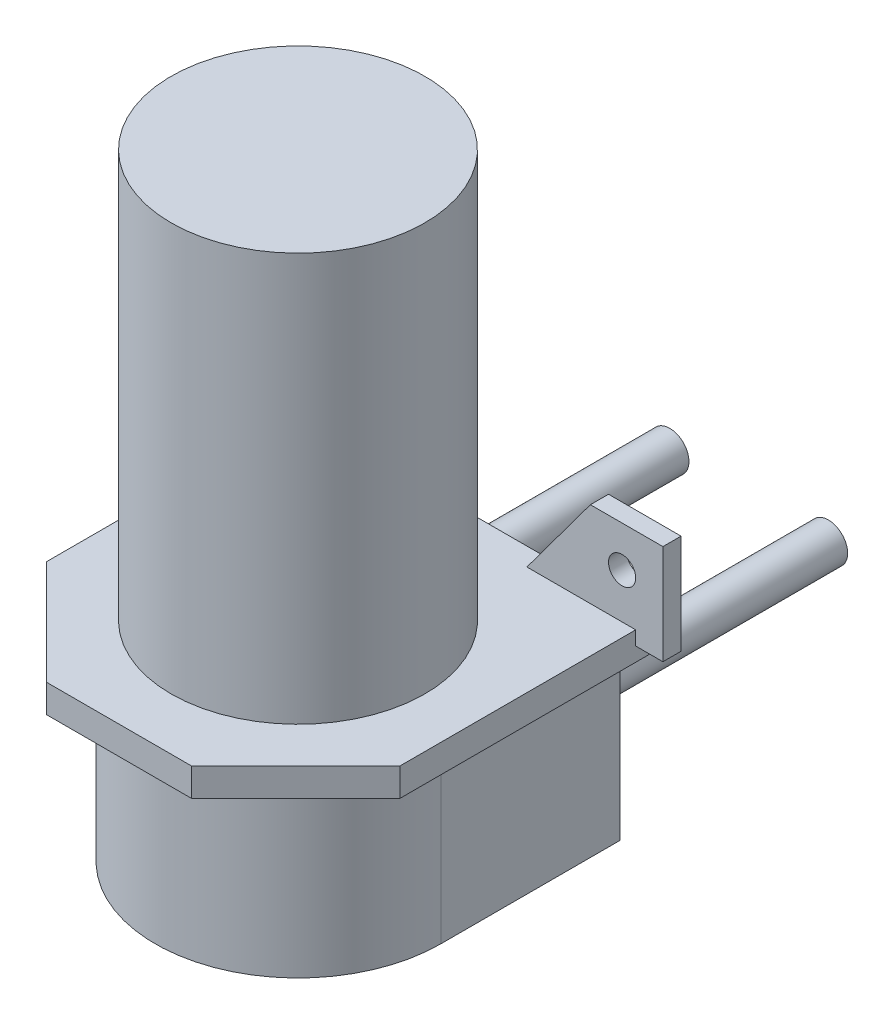
ISO-10303-21;
HEADER;
FILE_DESCRIPTION(('STEP AP214'),'2;1');
FILE_NAME('part.step','',(''),(''),'','','');
FILE_SCHEMA(('AUTOMOTIVE_DESIGN { 1 0 10303 214 1 1 1 1 }'));
ENDSEC;
DATA;
#1=APPLICATION_CONTEXT('core data for automotive mechanical design processes');
#2=APPLICATION_PROTOCOL_DEFINITION('international standard','automotive_design',2000,#1);
#3=PRODUCT_CONTEXT('',#1,'mechanical');
#4=PRODUCT('Part','Part','',(#3));
#5=PRODUCT_RELATED_PRODUCT_CATEGORY('part','',(#4));
#6=PRODUCT_DEFINITION_FORMATION('','',#4);
#7=PRODUCT_DEFINITION_CONTEXT('part definition',#1,'design');
#8=PRODUCT_DEFINITION('design','',#6,#7);
#9=PRODUCT_DEFINITION_SHAPE('','',#8);
#10=(LENGTH_UNIT() NAMED_UNIT(*) SI_UNIT(.MILLI.,.METRE.));
#11=(NAMED_UNIT(*) PLANE_ANGLE_UNIT() SI_UNIT($,.RADIAN.));
#12=(NAMED_UNIT(*) SI_UNIT($,.STERADIAN.) SOLID_ANGLE_UNIT());
#13=UNCERTAINTY_MEASURE_WITH_UNIT(LENGTH_MEASURE(1.E-05),#10,'distance_accuracy_value','');
#14=(GEOMETRIC_REPRESENTATION_CONTEXT(3) GLOBAL_UNCERTAINTY_ASSIGNED_CONTEXT((#13)) GLOBAL_UNIT_ASSIGNED_CONTEXT((#10,
#11,#12)) REPRESENTATION_CONTEXT('',''));
#15=CARTESIAN_POINT('',(0.,0.,0.));
#16=DIRECTION('',(0.,0.,1.));
#17=DIRECTION('',(1.,0.,0.));
#18=AXIS2_PLACEMENT_3D('',#15,#16,#17);
#19=CARTESIAN_POINT('',(-8.75,-13.,-49.75));
#20=DIRECTION('',(0.,0.,1.));
#21=DIRECTION('',(1.,0.,0.));
#22=AXIS2_PLACEMENT_3D('',#19,#20,#21);
#23=CYLINDRICAL_SURFACE('',#22,2.125);
#24=CARTESIAN_POINT('',(-8.75,-13.,-49.75));
#25=DIRECTION('',(0.,0.,-1.));
#26=DIRECTION('',(-1.,0.,0.));
#27=AXIS2_PLACEMENT_3D('',#24,#25,#26);
#28=CIRCLE('',#27,2.125);
#29=CARTESIAN_POINT('',(-10.875,-13.,-49.75));
#30=VERTEX_POINT('',#29);
#31=EDGE_CURVE('E11',#30,#30,#28,.T.);
#32=ORIENTED_EDGE('',*,*,#31,.F.);
#33=EDGE_LOOP('',(#32));
#34=FACE_BOUND('',#33,.T.);
#35=CARTESIAN_POINT('',(-8.75,-13.,-19.75));
#36=DIRECTION('',(0.,0.,-1.));
#37=DIRECTION('',(-1.,0.,0.));
#38=AXIS2_PLACEMENT_3D('',#35,#36,#37);
#39=CIRCLE('',#38,2.125);
#40=CARTESIAN_POINT('',(-10.875,-13.,-19.75));
#41=VERTEX_POINT('',#40);
#42=EDGE_CURVE('E53',#41,#41,#39,.T.);
#43=ORIENTED_EDGE('',*,*,#42,.T.);
#44=EDGE_LOOP('',(#43));
#45=FACE_BOUND('',#44,.T.);
#46=ADVANCED_FACE('F50',(#34,#45),#23,.T.);
#47=CARTESIAN_POINT('',(-8.75,-13.,-49.75));
#48=DIRECTION('',(0.,0.,-1.));
#49=DIRECTION('',(-1.,0.,0.));
#50=AXIS2_PLACEMENT_3D('',#47,#48,#49);
#51=PLANE('',#50);
#52=ORIENTED_EDGE('',*,*,#31,.T.);
#53=EDGE_LOOP('',(#52));
#54=FACE_BOUND('',#53,.T.);
#55=ADVANCED_FACE('F65',(#54),#51,.T.);
#56=CARTESIAN_POINT('',(-8.75,-13.,-19.75));
#57=DIRECTION('',(0.,0.,-1.));
#58=DIRECTION('',(-1.,0.,0.));
#59=AXIS2_PLACEMENT_3D('',#56,#57,#58);
#60=PLANE('',#59);
#61=ORIENTED_EDGE('',*,*,#42,.F.);
#62=EDGE_LOOP('',(#61));
#63=FACE_BOUND('',#62,.T.);
#64=ADVANCED_FACE('F63',(#63),#60,.F.);
#65=CLOSED_SHELL('',(#46,#55,#64));
#66=MANIFOLD_SOLID_BREP('B2',#65);
#67=CARTESIAN_POINT('',(8.75,-13.,-49.75));
#68=DIRECTION('',(0.,0.,1.));
#69=DIRECTION('',(1.,0.,0.));
#70=AXIS2_PLACEMENT_3D('',#67,#68,#69);
#71=CYLINDRICAL_SURFACE('',#70,2.125);
#72=CARTESIAN_POINT('',(8.75,-13.,-49.75));
#73=DIRECTION('',(0.,0.,-1.));
#74=DIRECTION('',(-1.,0.,0.));
#75=AXIS2_PLACEMENT_3D('',#72,#73,#74);
#76=CIRCLE('',#75,2.125);
#77=CARTESIAN_POINT('',(6.625,-13.,-49.75));
#78=VERTEX_POINT('',#77);
#79=EDGE_CURVE('E49',#78,#78,#76,.T.);
#80=ORIENTED_EDGE('',*,*,#79,.F.);
#81=EDGE_LOOP('',(#80));
#82=FACE_BOUND('',#81,.T.);
#83=CARTESIAN_POINT('',(8.75,-13.,-19.75));
#84=DIRECTION('',(0.,0.,-1.));
#85=DIRECTION('',(-1.,0.,0.));
#86=AXIS2_PLACEMENT_3D('',#83,#84,#85);
#87=CIRCLE('',#86,2.125);
#88=CARTESIAN_POINT('',(6.625,-13.,-19.75));
#89=VERTEX_POINT('',#88);
#90=EDGE_CURVE('E103',#89,#89,#87,.T.);
#91=ORIENTED_EDGE('',*,*,#90,.T.);
#92=EDGE_LOOP('',(#91));
#93=FACE_BOUND('',#92,.T.);
#94=ADVANCED_FACE('F100',(#82,#93),#71,.T.);
#95=CARTESIAN_POINT('',(8.75,-13.,-49.75));
#96=DIRECTION('',(0.,0.,-1.));
#97=DIRECTION('',(-1.,0.,0.));
#98=AXIS2_PLACEMENT_3D('',#95,#96,#97);
#99=PLANE('',#98);
#100=ORIENTED_EDGE('',*,*,#79,.T.);
#101=EDGE_LOOP('',(#100));
#102=FACE_BOUND('',#101,.T.);
#103=ADVANCED_FACE('F115',(#102),#99,.T.);
#104=CARTESIAN_POINT('',(8.75,-13.,-19.75));
#105=DIRECTION('',(0.,0.,-1.));
#106=DIRECTION('',(-1.,0.,0.));
#107=AXIS2_PLACEMENT_3D('',#104,#105,#106);
#108=PLANE('',#107);
#109=ORIENTED_EDGE('',*,*,#90,.F.);
#110=EDGE_LOOP('',(#109));
#111=FACE_BOUND('',#110,.T.);
#112=ADVANCED_FACE('F113',(#111),#108,.F.);
#113=CLOSED_SHELL('',(#94,#103,#112));
#114=MANIFOLD_SOLID_BREP('B6',#113);
#115=CARTESIAN_POINT('',(19.5,-3.1,8.25));
#116=DIRECTION('',(-1.,0.,0.));
#117=DIRECTION('',(0.,0.,1.));
#118=AXIS2_PLACEMENT_3D('',#115,#116,#117);
#119=PLANE('',#118);
#120=DIRECTION('',(0.,0.,-1.));
#121=VECTOR('',#120,1.);
#122=CARTESIAN_POINT('',(19.5,-1.55,-17.75));
#123=LINE('',#122,#121);
#124=CARTESIAN_POINT('',(19.5,-1.55,-17.75));
#125=VERTEX_POINT('',#124);
#126=CARTESIAN_POINT('',(19.5,-1.55,-19.75));
#127=VERTEX_POINT('',#126);
#128=EDGE_CURVE('E371',#125,#127,#123,.T.);
#129=ORIENTED_EDGE('',*,*,#128,.F.);
#130=DIRECTION('',(0.,-1.,0.));
#131=VECTOR('',#130,1.);
#132=CARTESIAN_POINT('',(19.5,0.,-17.75));
#133=LINE('',#132,#131);
#134=CARTESIAN_POINT('',(19.5,0.,-17.75));
#135=VERTEX_POINT('',#134);
#136=EDGE_CURVE('E352',#135,#125,#133,.T.);
#137=ORIENTED_EDGE('',*,*,#136,.F.);
#138=DIRECTION('',(0.,0.,1.));
#139=VECTOR('',#138,1.);
#140=CARTESIAN_POINT('',(19.5,0.,8.25));
#141=LINE('',#140,#139);
#142=CARTESIAN_POINT('',(19.5,0.,8.25));
#143=VERTEX_POINT('',#142);
#144=EDGE_CURVE('E417',#135,#143,#141,.T.);
#145=ORIENTED_EDGE('',*,*,#144,.T.);
#146=DIRECTION('',(0.,1.,0.));
#147=VECTOR('',#146,1.);
#148=CARTESIAN_POINT('',(19.5,-3.1,8.25));
#149=LINE('',#148,#147);
#150=CARTESIAN_POINT('',(19.5,-3.1,8.25));
#151=VERTEX_POINT('',#150);
#152=EDGE_CURVE('E456',#151,#143,#149,.T.);
#153=ORIENTED_EDGE('',*,*,#152,.F.);
#154=DIRECTION('',(0.,0.,1.));
#155=VECTOR('',#154,1.);
#156=CARTESIAN_POINT('',(19.5,-3.1,8.25));
#157=LINE('',#156,#155);
#158=CARTESIAN_POINT('',(19.5,-3.1,-19.75));
#159=VERTEX_POINT('',#158);
#160=EDGE_CURVE('E419',#159,#151,#157,.T.);
#161=ORIENTED_EDGE('',*,*,#160,.F.);
#162=DIRECTION('',(0.,1.,0.));
#163=VECTOR('',#162,1.);
#164=CARTESIAN_POINT('',(19.5,-3.1,-19.75));
#165=LINE('',#164,#163);
#166=EDGE_CURVE('E434',#159,#127,#165,.T.);
#167=ORIENTED_EDGE('',*,*,#166,.T.);
#168=EDGE_LOOP('',(#129,#137,#145,#153,#161,#167));
#169=FACE_BOUND('',#168,.T.);
#170=ADVANCED_FACE('F141',(#169),#119,.F.);
#171=CARTESIAN_POINT('',(0.,0.,0.));
#172=DIRECTION('',(0.,-1.,0.));
#173=DIRECTION('',(0.,0.,-1.));
#174=AXIS2_PLACEMENT_3D('',#171,#172,#173);
#175=PLANE('',#174);
#176=CARTESIAN_POINT('',(0.,0.,0.));
#177=DIRECTION('',(0.,1.,0.));
#178=DIRECTION('',(0.,0.,1.));
#179=AXIS2_PLACEMENT_3D('',#176,#177,#178);
#180=CIRCLE('',#179,14.);
#181=CARTESIAN_POINT('',(0.,0.,14.));
#182=VERTEX_POINT('',#181);
#183=EDGE_CURVE('E145',#182,#182,#180,.T.);
#184=ORIENTED_EDGE('',*,*,#183,.F.);
#185=EDGE_LOOP('',(#184));
#186=FACE_BOUND('',#185,.T.);
#187=DIRECTION('',(1.,0.,0.));
#188=VECTOR('',#187,1.);
#189=CARTESIAN_POINT('',(-19.5,0.,-19.75));
#190=LINE('',#189,#188);
#191=CARTESIAN_POINT('',(-7.50000000000001,0.,-19.75));
#192=VERTEX_POINT('',#191);
#193=CARTESIAN_POINT('',(7.49999999999999,0.,-19.75));
#194=VERTEX_POINT('',#193);
#195=EDGE_CURVE('E423',#192,#194,#190,.T.);
#196=ORIENTED_EDGE('',*,*,#195,.F.);
#197=DIRECTION('',(0.,0.,-1.));
#198=VECTOR('',#197,1.);
#199=CARTESIAN_POINT('',(-7.50000000000001,0.,-17.75));
#200=LINE('',#199,#198);
#201=CARTESIAN_POINT('',(-7.50000000000001,0.,-17.75));
#202=VERTEX_POINT('',#201);
#203=EDGE_CURVE('E332',#202,#192,#200,.T.);
#204=ORIENTED_EDGE('',*,*,#203,.F.);
#205=DIRECTION('',(1.,0.,0.));
#206=VECTOR('',#205,1.);
#207=CARTESIAN_POINT('',(0.,0.,-17.75));
#208=LINE('',#207,#206);
#209=CARTESIAN_POINT('',(-19.5,0.,-17.75));
#210=VERTEX_POINT('',#209);
#211=EDGE_CURVE('E320',#210,#202,#208,.T.);
#212=ORIENTED_EDGE('',*,*,#211,.F.);
#213=DIRECTION('',(0.,0.,-1.));
#214=VECTOR('',#213,1.);
#215=CARTESIAN_POINT('',(-19.5,0.,8.25));
#216=LINE('',#215,#214);
#217=CARTESIAN_POINT('',(-19.5,0.,8.25));
#218=VERTEX_POINT('',#217);
#219=EDGE_CURVE('E308',#218,#210,#216,.T.);
#220=ORIENTED_EDGE('',*,*,#219,.F.);
#221=DIRECTION('',(-0.70710678118655,0.,-0.707106781186545));
#222=VECTOR('',#221,1.);
#223=CARTESIAN_POINT('',(-8.,0.,19.7499999999999));
#224=LINE('',#223,#222);
#225=CARTESIAN_POINT('',(-8.,0.,19.7499999999999));
#226=VERTEX_POINT('',#225);
#227=EDGE_CURVE('E440',#226,#218,#224,.T.);
#228=ORIENTED_EDGE('',*,*,#227,.F.);
#229=DIRECTION('',(-1.,0.,0.));
#230=VECTOR('',#229,1.);
#231=CARTESIAN_POINT('',(-8.,0.,19.7499999999999));
#232=LINE('',#231,#230);
#233=CARTESIAN_POINT('',(8.,0.,19.75));
#234=VERTEX_POINT('',#233);
#235=EDGE_CURVE('E438',#234,#226,#232,.T.);
#236=ORIENTED_EDGE('',*,*,#235,.F.);
#237=DIRECTION('',(-0.707106781186547,0.,0.707106781186548));
#238=VECTOR('',#237,1.);
#239=CARTESIAN_POINT('',(8.,0.,19.75));
#240=LINE('',#239,#238);
#241=EDGE_CURVE('E436',#143,#234,#240,.T.);
#242=ORIENTED_EDGE('',*,*,#241,.F.);
#243=ORIENTED_EDGE('',*,*,#144,.F.);
#244=DIRECTION('',(1.,0.,0.));
#245=VECTOR('',#244,1.);
#246=CARTESIAN_POINT('',(0.,0.,-17.75));
#247=LINE('',#246,#245);
#248=CARTESIAN_POINT('',(7.49999999999999,0.,-17.75));
#249=VERTEX_POINT('',#248);
#250=EDGE_CURVE('E354',#249,#135,#247,.T.);
#251=ORIENTED_EDGE('',*,*,#250,.F.);
#252=DIRECTION('',(0.,0.,-1.));
#253=VECTOR('',#252,1.);
#254=CARTESIAN_POINT('',(7.49999999999999,0.,-17.75));
#255=LINE('',#254,#253);
#256=EDGE_CURVE('E367',#249,#194,#255,.T.);
#257=ORIENTED_EDGE('',*,*,#256,.T.);
#258=EDGE_LOOP('',(#196,#204,#212,#220,#228,#236,#242,#243,#251,#257));
#259=FACE_BOUND('',#258,.T.);
#260=ADVANCED_FACE('F465',(#186,#259),#175,.F.);
#261=CARTESIAN_POINT('',(0.,-3.1,0.));
#262=DIRECTION('',(0.,-1.,0.));
#263=DIRECTION('',(0.,0.,-1.));
#264=AXIS2_PLACEMENT_3D('',#261,#262,#263);
#265=PLANE('',#264);
#266=DIRECTION('',(1.,0.,0.));
#267=VECTOR('',#266,1.);
#268=CARTESIAN_POINT('',(-19.5,-3.1,-19.75));
#269=LINE('',#268,#267);
#270=CARTESIAN_POINT('',(-19.5,-3.1,-19.75));
#271=VERTEX_POINT('',#270);
#272=CARTESIAN_POINT('',(-15.75,-3.1,-19.75));
#273=VERTEX_POINT('',#272);
#274=EDGE_CURVE('E432',#271,#273,#269,.T.);
#275=ORIENTED_EDGE('',*,*,#274,.T.);
#276=DIRECTION('',(0.,0.,-1.));
#277=VECTOR('',#276,1.);
#278=CARTESIAN_POINT('',(-15.75,-3.1,0.));
#279=LINE('',#278,#277);
#280=CARTESIAN_POINT('',(-15.75,-3.1,0.));
#281=VERTEX_POINT('',#280);
#282=EDGE_CURVE('E401',#281,#273,#279,.T.);
#283=ORIENTED_EDGE('',*,*,#282,.F.);
#284=CARTESIAN_POINT('',(0.,-3.1,0.));
#285=DIRECTION('',(0.,-1.,0.));
#286=DIRECTION('',(0.,0.,-1.));
#287=AXIS2_PLACEMENT_3D('',#284,#285,#286);
#288=CIRCLE('',#287,15.75);
#289=CARTESIAN_POINT('',(15.75,-3.1,0.));
#290=VERTEX_POINT('',#289);
#291=EDGE_CURVE('E98',#290,#281,#288,.T.);
#292=ORIENTED_EDGE('',*,*,#291,.F.);
#293=DIRECTION('',(0.,0.,1.));
#294=VECTOR('',#293,1.);
#295=CARTESIAN_POINT('',(15.75,-3.1,0.));
#296=LINE('',#295,#294);
#297=CARTESIAN_POINT('',(15.75,-3.1,-19.75));
#298=VERTEX_POINT('',#297);
#299=EDGE_CURVE('E166',#298,#290,#296,.T.);
#300=ORIENTED_EDGE('',*,*,#299,.F.);
#301=EDGE_CURVE('E431',#298,#159,#269,.T.);
#302=ORIENTED_EDGE('',*,*,#301,.T.);
#303=ORIENTED_EDGE('',*,*,#160,.T.);
#304=DIRECTION('',(-0.707106781186547,0.,0.707106781186548));
#305=VECTOR('',#304,1.);
#306=CARTESIAN_POINT('',(8.,-3.1,19.75));
#307=LINE('',#306,#305);
#308=CARTESIAN_POINT('',(8.,-3.1,19.75));
#309=VERTEX_POINT('',#308);
#310=EDGE_CURVE('E422',#151,#309,#307,.T.);
#311=ORIENTED_EDGE('',*,*,#310,.T.);
#312=DIRECTION('',(-1.,0.,0.));
#313=VECTOR('',#312,1.);
#314=CARTESIAN_POINT('',(-8.,-3.1,19.7499999999999));
#315=LINE('',#314,#313);
#316=CARTESIAN_POINT('',(-8.,-3.1,19.7499999999999));
#317=VERTEX_POINT('',#316);
#318=EDGE_CURVE('E425',#309,#317,#315,.T.);
#319=ORIENTED_EDGE('',*,*,#318,.T.);
#320=DIRECTION('',(-0.70710678118655,0.,-0.707106781186545));
#321=VECTOR('',#320,1.);
#322=CARTESIAN_POINT('',(-8.,-3.1,19.7499999999999));
#323=LINE('',#322,#321);
#324=CARTESIAN_POINT('',(-19.5,-3.1,8.25));
#325=VERTEX_POINT('',#324);
#326=EDGE_CURVE('E427',#317,#325,#323,.T.);
#327=ORIENTED_EDGE('',*,*,#326,.T.);
#328=DIRECTION('',(0.,0.,-1.));
#329=VECTOR('',#328,1.);
#330=CARTESIAN_POINT('',(-19.5,-3.1,8.25));
#331=LINE('',#330,#329);
#332=EDGE_CURVE('E429',#325,#271,#331,.T.);
#333=ORIENTED_EDGE('',*,*,#332,.T.);
#334=EDGE_LOOP('',(#275,#283,#292,#300,#302,#303,#311,#319,#327,#333));
#335=FACE_BOUND('',#334,.T.);
#336=ADVANCED_FACE('F468',(#335),#265,.T.);
#337=CARTESIAN_POINT('',(0.,-23.,0.));
#338=DIRECTION('',(0.,1.,0.));
#339=DIRECTION('',(0.,0.,1.));
#340=AXIS2_PLACEMENT_3D('',#337,#338,#339);
#341=CYLINDRICAL_SURFACE('',#340,15.75);
#342=ORIENTED_EDGE('',*,*,#291,.T.);
#343=DIRECTION('',(0.,1.,0.));
#344=VECTOR('',#343,1.);
#345=CARTESIAN_POINT('',(-15.75,-60.1794634173222,0.));
#346=LINE('',#345,#344);
#347=CARTESIAN_POINT('',(-15.75,-23.,0.));
#348=VERTEX_POINT('',#347);
#349=EDGE_CURVE('E410',#348,#281,#346,.T.);
#350=ORIENTED_EDGE('',*,*,#349,.F.);
#351=CARTESIAN_POINT('',(0.,-23.,0.));
#352=DIRECTION('',(0.,1.,0.));
#353=DIRECTION('',(0.,0.,1.));
#354=AXIS2_PLACEMENT_3D('',#351,#352,#353);
#355=CIRCLE('',#354,15.75);
#356=CARTESIAN_POINT('',(15.75,-23.,0.));
#357=VERTEX_POINT('',#356);
#358=EDGE_CURVE('E399',#348,#357,#355,.T.);
#359=ORIENTED_EDGE('',*,*,#358,.T.);
#360=DIRECTION('',(0.,1.,0.));
#361=VECTOR('',#360,1.);
#362=CARTESIAN_POINT('',(15.75,-60.1794634173222,0.));
#363=LINE('',#362,#361);
#364=EDGE_CURVE('E413',#357,#290,#363,.T.);
#365=ORIENTED_EDGE('',*,*,#364,.T.);
#366=EDGE_LOOP('',(#342,#350,#359,#365));
#367=FACE_BOUND('',#366,.T.);
#368=ADVANCED_FACE('F515',(#367),#341,.T.);
#369=CARTESIAN_POINT('',(0.,45.,0.));
#370=DIRECTION('',(0.,-1.,0.));
#371=DIRECTION('',(0.,0.,-1.));
#372=AXIS2_PLACEMENT_3D('',#369,#370,#371);
#373=CYLINDRICAL_SURFACE('',#372,14.);
#374=CARTESIAN_POINT('',(0.,45.,0.));
#375=DIRECTION('',(0.,1.,0.));
#376=DIRECTION('',(0.,0.,1.));
#377=AXIS2_PLACEMENT_3D('',#374,#375,#376);
#378=CIRCLE('',#377,14.);
#379=CARTESIAN_POINT('',(0.,45.,14.));
#380=VERTEX_POINT('',#379);
#381=EDGE_CURVE('E150',#380,#380,#378,.T.);
#382=ORIENTED_EDGE('',*,*,#381,.F.);
#383=EDGE_LOOP('',(#382));
#384=FACE_BOUND('',#383,.T.);
#385=ORIENTED_EDGE('',*,*,#183,.T.);
#386=EDGE_LOOP('',(#385));
#387=FACE_BOUND('',#386,.T.);
#388=ADVANCED_FACE('F143',(#384,#387),#373,.T.);
#389=CARTESIAN_POINT('',(0.,45.,0.));
#390=DIRECTION('',(0.,1.,0.));
#391=DIRECTION('',(0.,0.,1.));
#392=AXIS2_PLACEMENT_3D('',#389,#390,#391);
#393=PLANE('',#392);
#394=ORIENTED_EDGE('',*,*,#381,.T.);
#395=EDGE_LOOP('',(#394));
#396=FACE_BOUND('',#395,.T.);
#397=ADVANCED_FACE('F523',(#396),#393,.T.);
#398=CARTESIAN_POINT('',(8.,-3.1,19.75));
#399=DIRECTION('',(-0.707106781186548,0.,-0.707106781186547));
#400=DIRECTION('',(-0.707106781186547,0.,0.707106781186548));
#401=AXIS2_PLACEMENT_3D('',#398,#399,#400);
#402=PLANE('',#401);
#403=ORIENTED_EDGE('',*,*,#241,.T.);
#404=DIRECTION('',(0.,1.,0.));
#405=VECTOR('',#404,1.);
#406=CARTESIAN_POINT('',(8.,-3.1,19.75));
#407=LINE('',#406,#405);
#408=EDGE_CURVE('E453',#309,#234,#407,.T.);
#409=ORIENTED_EDGE('',*,*,#408,.F.);
#410=ORIENTED_EDGE('',*,*,#310,.F.);
#411=ORIENTED_EDGE('',*,*,#152,.T.);
#412=EDGE_LOOP('',(#403,#409,#410,#411));
#413=FACE_BOUND('',#412,.T.);
#414=ADVANCED_FACE('F533',(#413),#402,.F.);
#415=CARTESIAN_POINT('',(-8.,-3.1,19.7499999999999));
#416=DIRECTION('',(0.,0.,-1.));
#417=DIRECTION('',(-1.,0.,0.));
#418=AXIS2_PLACEMENT_3D('',#415,#416,#417);
#419=PLANE('',#418);
#420=ORIENTED_EDGE('',*,*,#235,.T.);
#421=DIRECTION('',(0.,1.,0.));
#422=VECTOR('',#421,1.);
#423=CARTESIAN_POINT('',(-8.,-3.1,19.7499999999999));
#424=LINE('',#423,#422);
#425=EDGE_CURVE('E450',#317,#226,#424,.T.);
#426=ORIENTED_EDGE('',*,*,#425,.F.);
#427=ORIENTED_EDGE('',*,*,#318,.F.);
#428=ORIENTED_EDGE('',*,*,#408,.T.);
#429=EDGE_LOOP('',(#420,#426,#427,#428));
#430=FACE_BOUND('',#429,.T.);
#431=ADVANCED_FACE('F539',(#430),#419,.F.);
#432=CARTESIAN_POINT('',(-8.,-3.1,19.7499999999999));
#433=DIRECTION('',(0.707106781186545,0.,-0.70710678118655));
#434=DIRECTION('',(-0.70710678118655,0.,-0.707106781186545));
#435=AXIS2_PLACEMENT_3D('',#432,#433,#434);
#436=PLANE('',#435);
#437=ORIENTED_EDGE('',*,*,#227,.T.);
#438=DIRECTION('',(0.,1.,0.));
#439=VECTOR('',#438,1.);
#440=CARTESIAN_POINT('',(-19.5,-3.1,8.25));
#441=LINE('',#440,#439);
#442=EDGE_CURVE('E448',#325,#218,#441,.T.);
#443=ORIENTED_EDGE('',*,*,#442,.F.);
#444=ORIENTED_EDGE('',*,*,#326,.F.);
#445=ORIENTED_EDGE('',*,*,#425,.T.);
#446=EDGE_LOOP('',(#437,#443,#444,#445));
#447=FACE_BOUND('',#446,.T.);
#448=ADVANCED_FACE('F544',(#447),#436,.F.);
#449=CARTESIAN_POINT('',(-19.5,-3.1,8.25));
#450=DIRECTION('',(1.,0.,0.));
#451=DIRECTION('',(0.,0.,-1.));
#452=AXIS2_PLACEMENT_3D('',#449,#450,#451);
#453=PLANE('',#452);
#454=DIRECTION('',(0.,1.,0.));
#455=VECTOR('',#454,1.);
#456=CARTESIAN_POINT('',(-19.5,0.,-17.75));
#457=LINE('',#456,#455);
#458=CARTESIAN_POINT('',(-19.5,-1.54999999999978,-17.75));
#459=VERTEX_POINT('',#458);
#460=EDGE_CURVE('E299',#459,#210,#457,.T.);
#461=ORIENTED_EDGE('',*,*,#460,.F.);
#462=DIRECTION('',(0.,0.,-1.));
#463=VECTOR('',#462,1.);
#464=CARTESIAN_POINT('',(-19.5,-1.54999999999978,-17.75));
#465=LINE('',#464,#463);
#466=CARTESIAN_POINT('',(-19.5,-1.54999999999978,-19.75));
#467=VERTEX_POINT('',#466);
#468=EDGE_CURVE('E282',#459,#467,#465,.T.);
#469=ORIENTED_EDGE('',*,*,#468,.T.);
#470=DIRECTION('',(0.,1.,0.));
#471=VECTOR('',#470,1.);
#472=CARTESIAN_POINT('',(-19.5,-3.1,-19.75));
#473=LINE('',#472,#471);
#474=EDGE_CURVE('E446',#271,#467,#473,.T.);
#475=ORIENTED_EDGE('',*,*,#474,.F.);
#476=ORIENTED_EDGE('',*,*,#332,.F.);
#477=ORIENTED_EDGE('',*,*,#442,.T.);
#478=ORIENTED_EDGE('',*,*,#219,.T.);
#479=EDGE_LOOP('',(#461,#469,#475,#476,#477,#478));
#480=FACE_BOUND('',#479,.T.);
#481=ADVANCED_FACE('F305',(#480),#453,.F.);
#482=CARTESIAN_POINT('',(-19.5,-3.1,-19.75));
#483=DIRECTION('',(0.,0.,1.));
#484=DIRECTION('',(1.,0.,0.));
#485=AXIS2_PLACEMENT_3D('',#482,#483,#484);
#486=PLANE('',#485);
#487=DIRECTION('',(1.,0.,0.));
#488=VECTOR('',#487,1.);
#489=CARTESIAN_POINT('',(0.,-1.55,-19.75));
#490=LINE('',#489,#488);
#491=CARTESIAN_POINT('',(22.5,-1.55,-19.75));
#492=VERTEX_POINT('',#491);
#493=EDGE_CURVE('E344',#127,#492,#490,.T.);
#494=ORIENTED_EDGE('',*,*,#493,.F.);
#495=ORIENTED_EDGE('',*,*,#166,.F.);
#496=ORIENTED_EDGE('',*,*,#301,.F.);
#497=DIRECTION('',(0.,1.,0.));
#498=VECTOR('',#497,1.);
#499=CARTESIAN_POINT('',(15.75,-60.1794634173222,-19.75));
#500=LINE('',#499,#498);
#501=CARTESIAN_POINT('',(15.75,-23.,-19.75));
#502=VERTEX_POINT('',#501);
#503=EDGE_CURVE('E404',#502,#298,#500,.T.);
#504=ORIENTED_EDGE('',*,*,#503,.F.);
#505=DIRECTION('',(-1.,0.,0.));
#506=VECTOR('',#505,1.);
#507=CARTESIAN_POINT('',(15.75,-23.,-19.75));
#508=LINE('',#507,#506);
#509=CARTESIAN_POINT('',(-15.75,-23.,-19.75));
#510=VERTEX_POINT('',#509);
#511=EDGE_CURVE('E396',#502,#510,#508,.T.);
#512=ORIENTED_EDGE('',*,*,#511,.T.);
#513=DIRECTION('',(0.,1.,0.));
#514=VECTOR('',#513,1.);
#515=CARTESIAN_POINT('',(-15.75,-60.1794634173222,-19.75));
#516=LINE('',#515,#514);
#517=EDGE_CURVE('E407',#510,#273,#516,.T.);
#518=ORIENTED_EDGE('',*,*,#517,.T.);
#519=ORIENTED_EDGE('',*,*,#274,.F.);
#520=ORIENTED_EDGE('',*,*,#474,.T.);
#521=DIRECTION('',(-1.,0.,0.));
#522=VECTOR('',#521,1.);
#523=CARTESIAN_POINT('',(0.,-1.54999999999978,-19.75));
#524=LINE('',#523,#522);
#525=CARTESIAN_POINT('',(-22.5,-1.54999999999978,-19.75));
#526=VERTEX_POINT('',#525);
#527=EDGE_CURVE('E287',#467,#526,#524,.T.);
#528=ORIENTED_EDGE('',*,*,#527,.T.);
#529=DIRECTION('',(0.,1.,0.));
#530=VECTOR('',#529,1.);
#531=CARTESIAN_POINT('',(-22.5,1.56125112837916E-13,-19.75));
#532=LINE('',#531,#530);
#533=CARTESIAN_POINT('',(-22.4999999999999,9.45,-19.75));
#534=VERTEX_POINT('',#533);
#535=EDGE_CURVE('E325',#526,#534,#532,.T.);
#536=ORIENTED_EDGE('',*,*,#535,.T.);
#537=DIRECTION('',(-1.,0.,0.));
#538=VECTOR('',#537,1.);
#539=CARTESIAN_POINT('',(0.,9.45,-19.75));
#540=LINE('',#539,#538);
#541=CARTESIAN_POINT('',(-14.4999999999999,9.45,-19.75));
#542=VERTEX_POINT('',#541);
#543=EDGE_CURVE('E328',#542,#534,#540,.T.);
#544=ORIENTED_EDGE('',*,*,#543,.F.);
#545=DIRECTION('',(0.595227550625734,-0.803557193344749,0.));
#546=VECTOR('',#545,1.);
#547=CARTESIAN_POINT('',(-4.84278122232068,-3.58724534986713,-19.75));
#548=LINE('',#547,#546);
#549=EDGE_CURVE('E158',#542,#192,#548,.T.);
#550=ORIENTED_EDGE('',*,*,#549,.T.);
#551=ORIENTED_EDGE('',*,*,#195,.T.);
#552=DIRECTION('',(-0.595227550625738,-0.803557193344746,0.));
#553=VECTOR('',#552,1.);
#554=CARTESIAN_POINT('',(4.84278122232064,-3.58724534986714,-19.75));
#555=LINE('',#554,#553);
#556=CARTESIAN_POINT('',(14.5,9.45,-19.75));
#557=VERTEX_POINT('',#556);
#558=EDGE_CURVE('E359',#557,#194,#555,.T.);
#559=ORIENTED_EDGE('',*,*,#558,.F.);
#560=DIRECTION('',(-1.,0.,0.));
#561=VECTOR('',#560,1.);
#562=CARTESIAN_POINT('',(0.,9.45,-19.75));
#563=LINE('',#562,#561);
#564=CARTESIAN_POINT('',(22.5,9.45,-19.75));
#565=VERTEX_POINT('',#564);
#566=EDGE_CURVE('E362',#565,#557,#563,.T.);
#567=ORIENTED_EDGE('',*,*,#566,.F.);
#568=DIRECTION('',(0.,1.,0.));
#569=VECTOR('',#568,1.);
#570=CARTESIAN_POINT('',(22.5,0.,-19.75));
#571=LINE('',#570,#569);
#572=EDGE_CURVE('E364',#492,#565,#571,.T.);
#573=ORIENTED_EDGE('',*,*,#572,.F.);
#574=EDGE_LOOP('',(#494,#495,#496,#504,#512,#518,#519,#520,#528,#536,#544,#550,#551,#559,#567,#573));
#575=FACE_BOUND('',#574,.T.);
#576=CARTESIAN_POINT('',(8.75,-13.,-19.75));
#577=DIRECTION('',(0.,0.,-1.));
#578=DIRECTION('',(-1.,0.,0.));
#579=AXIS2_PLACEMENT_3D('',#576,#577,#578);
#580=CIRCLE('',#579,2.125);
#581=CARTESIAN_POINT('',(6.625,-13.,-19.75));
#582=VERTEX_POINT('',#581);
#583=EDGE_CURVE('E384',#582,#582,#580,.T.);
#584=ORIENTED_EDGE('',*,*,#583,.F.);
#585=EDGE_LOOP('',(#584));
#586=FACE_BOUND('',#585,.T.);
#587=CARTESIAN_POINT('',(-8.75,-13.,-19.75));
#588=DIRECTION('',(0.,0.,-1.));
#589=DIRECTION('',(-1.,0.,0.));
#590=AXIS2_PLACEMENT_3D('',#587,#588,#589);
#591=CIRCLE('',#590,2.125);
#592=CARTESIAN_POINT('',(-10.875,-13.,-19.75));
#593=VERTEX_POINT('',#592);
#594=EDGE_CURVE('E370',#593,#593,#591,.T.);
#595=ORIENTED_EDGE('',*,*,#594,.F.);
#596=EDGE_LOOP('',(#595));
#597=FACE_BOUND('',#596,.T.);
#598=CARTESIAN_POINT('',(18.,4.95,-19.75));
#599=DIRECTION('',(0.,0.,-1.));
#600=DIRECTION('',(-1.,0.,0.));
#601=AXIS2_PLACEMENT_3D('',#598,#599,#600);
#602=CIRCLE('',#601,1.5);
#603=CARTESIAN_POINT('',(16.5,4.95,-19.75));
#604=VERTEX_POINT('',#603);
#605=EDGE_CURVE('E334',#604,#604,#602,.T.);
#606=ORIENTED_EDGE('',*,*,#605,.F.);
#607=EDGE_LOOP('',(#606));
#608=FACE_BOUND('',#607,.T.);
#609=CARTESIAN_POINT('',(-18.,4.95,-19.75));
#610=DIRECTION('',(0.,0.,-1.));
#611=DIRECTION('',(-1.,0.,0.));
#612=AXIS2_PLACEMENT_3D('',#609,#610,#611);
#613=CIRCLE('',#612,1.5);
#614=CARTESIAN_POINT('',(-19.5,4.95,-19.75));
#615=VERTEX_POINT('',#614);
#616=EDGE_CURVE('E309',#615,#615,#613,.F.);
#617=ORIENTED_EDGE('',*,*,#616,.T.);
#618=EDGE_LOOP('',(#617));
#619=FACE_BOUND('',#618,.T.);
#620=ADVANCED_FACE('F476',(#575,#586,#597,#608,#619),#486,.F.);
#621=CARTESIAN_POINT('',(0.,-23.,0.));
#622=DIRECTION('',(0.,1.,0.));
#623=DIRECTION('',(0.,0.,1.));
#624=AXIS2_PLACEMENT_3D('',#621,#622,#623);
#625=PLANE('',#624);
#626=ORIENTED_EDGE('',*,*,#358,.F.);
#627=DIRECTION('',(0.,0.,1.));
#628=VECTOR('',#627,1.);
#629=CARTESIAN_POINT('',(-15.75,-23.,0.));
#630=LINE('',#629,#628);
#631=EDGE_CURVE('E392',#510,#348,#630,.T.);
#632=ORIENTED_EDGE('',*,*,#631,.F.);
#633=ORIENTED_EDGE('',*,*,#511,.F.);
#634=DIRECTION('',(0.,0.,-1.));
#635=VECTOR('',#634,1.);
#636=CARTESIAN_POINT('',(15.75,-23.,0.));
#637=LINE('',#636,#635);
#638=EDGE_CURVE('E395',#357,#502,#637,.T.);
#639=ORIENTED_EDGE('',*,*,#638,.F.);
#640=EDGE_LOOP('',(#626,#632,#633,#639));
#641=FACE_BOUND('',#640,.T.);
#642=ADVANCED_FACE('F508',(#641),#625,.F.);
#643=CARTESIAN_POINT('',(-15.75,-60.1794634173222,0.));
#644=DIRECTION('',(1.,0.,0.));
#645=DIRECTION('',(0.,0.,-1.));
#646=AXIS2_PLACEMENT_3D('',#643,#644,#645);
#647=PLANE('',#646);
#648=ORIENTED_EDGE('',*,*,#517,.F.);
#649=ORIENTED_EDGE('',*,*,#631,.T.);
#650=ORIENTED_EDGE('',*,*,#349,.T.);
#651=ORIENTED_EDGE('',*,*,#282,.T.);
#652=EDGE_LOOP('',(#648,#649,#650,#651));
#653=FACE_BOUND('',#652,.T.);
#654=ADVANCED_FACE('F513',(#653),#647,.F.);
#655=CARTESIAN_POINT('',(15.75,-60.1794634173222,0.));
#656=DIRECTION('',(-1.,0.,0.));
#657=DIRECTION('',(0.,0.,1.));
#658=AXIS2_PLACEMENT_3D('',#655,#656,#657);
#659=PLANE('',#658);
#660=ORIENTED_EDGE('',*,*,#364,.F.);
#661=ORIENTED_EDGE('',*,*,#638,.T.);
#662=ORIENTED_EDGE('',*,*,#503,.T.);
#663=ORIENTED_EDGE('',*,*,#299,.T.);
#664=EDGE_LOOP('',(#660,#661,#662,#663));
#665=FACE_BOUND('',#664,.T.);
#666=ADVANCED_FACE('F505',(#665),#659,.F.);
#667=CARTESIAN_POINT('',(-8.75,-13.,-0.149999999999994));
#668=DIRECTION('',(0.,0.,-1.));
#669=DIRECTION('',(-1.,0.,0.));
#670=AXIS2_PLACEMENT_3D('',#667,#668,#669);
#671=CYLINDRICAL_SURFACE('',#670,2.125);
#672=CARTESIAN_POINT('',(-8.75,-13.,-0.149999999999994));
#673=DIRECTION('',(0.,0.,-1.));
#674=DIRECTION('',(-1.,0.,0.));
#675=AXIS2_PLACEMENT_3D('',#672,#673,#674);
#676=CIRCLE('',#675,2.125);
#677=CARTESIAN_POINT('',(-10.875,-13.,-0.149999999999994));
#678=VERTEX_POINT('',#677);
#679=EDGE_CURVE('E387',#678,#678,#676,.T.);
#680=ORIENTED_EDGE('',*,*,#679,.F.);
#681=EDGE_LOOP('',(#680));
#682=FACE_BOUND('',#681,.T.);
#683=ORIENTED_EDGE('',*,*,#594,.T.);
#684=EDGE_LOOP('',(#683));
#685=FACE_BOUND('',#684,.T.);
#686=ADVANCED_FACE('F593',(#682,#685),#671,.F.);
#687=CARTESIAN_POINT('',(-8.75,-13.,-0.149999999999994));
#688=DIRECTION('',(0.,0.,-1.));
#689=DIRECTION('',(-1.,0.,0.));
#690=AXIS2_PLACEMENT_3D('',#687,#688,#689);
#691=PLANE('',#690);
#692=ORIENTED_EDGE('',*,*,#679,.T.);
#693=EDGE_LOOP('',(#692));
#694=FACE_BOUND('',#693,.T.);
#695=ADVANCED_FACE('F589',(#694),#691,.T.);
#696=CARTESIAN_POINT('',(8.75,-13.,-0.149999999999994));
#697=DIRECTION('',(0.,0.,-1.));
#698=DIRECTION('',(-1.,0.,0.));
#699=AXIS2_PLACEMENT_3D('',#696,#697,#698);
#700=CYLINDRICAL_SURFACE('',#699,2.125);
#701=CARTESIAN_POINT('',(8.75,-13.,-0.149999999999994));
#702=DIRECTION('',(0.,0.,-1.));
#703=DIRECTION('',(-1.,0.,0.));
#704=AXIS2_PLACEMENT_3D('',#701,#702,#703);
#705=CIRCLE('',#704,2.125);
#706=CARTESIAN_POINT('',(6.625,-13.,-0.149999999999994));
#707=VERTEX_POINT('',#706);
#708=EDGE_CURVE('E381',#707,#707,#705,.T.);
#709=ORIENTED_EDGE('',*,*,#708,.F.);
#710=EDGE_LOOP('',(#709));
#711=FACE_BOUND('',#710,.T.);
#712=ORIENTED_EDGE('',*,*,#583,.T.);
#713=EDGE_LOOP('',(#712));
#714=FACE_BOUND('',#713,.T.);
#715=ADVANCED_FACE('F585',(#711,#714),#700,.F.);
#716=CARTESIAN_POINT('',(8.75,-13.,-0.149999999999994));
#717=DIRECTION('',(0.,0.,-1.));
#718=DIRECTION('',(-1.,0.,0.));
#719=AXIS2_PLACEMENT_3D('',#716,#717,#718);
#720=PLANE('',#719);
#721=ORIENTED_EDGE('',*,*,#708,.T.);
#722=EDGE_LOOP('',(#721));
#723=FACE_BOUND('',#722,.T.);
#724=ADVANCED_FACE('F580',(#723),#720,.T.);
#725=CARTESIAN_POINT('',(4.84278122232064,-3.58724534986714,-17.75));
#726=DIRECTION('',(0.803557193344746,-0.595227550625737,0.));
#727=DIRECTION('',(0.595227550625737,0.803557193344746,0.));
#728=AXIS2_PLACEMENT_3D('',#725,#726,#727);
#729=PLANE('',#728);
#730=ORIENTED_EDGE('',*,*,#558,.T.);
#731=ORIENTED_EDGE('',*,*,#256,.F.);
#732=DIRECTION('',(-0.595227550625738,-0.803557193344746,0.));
#733=VECTOR('',#732,1.);
#734=CARTESIAN_POINT('',(4.84278122232064,-3.58724534986714,-17.75));
#735=LINE('',#734,#733);
#736=CARTESIAN_POINT('',(14.5,9.45,-17.75));
#737=VERTEX_POINT('',#736);
#738=EDGE_CURVE('E343',#737,#249,#735,.T.);
#739=ORIENTED_EDGE('',*,*,#738,.F.);
#740=DIRECTION('',(0.,0.,-1.));
#741=VECTOR('',#740,1.);
#742=CARTESIAN_POINT('',(14.5,9.45,-17.75));
#743=LINE('',#742,#741);
#744=EDGE_CURVE('E356',#737,#557,#743,.T.);
#745=ORIENTED_EDGE('',*,*,#744,.T.);
#746=EDGE_LOOP('',(#730,#731,#739,#745));
#747=FACE_BOUND('',#746,.T.);
#748=ADVANCED_FACE('F480',(#747),#729,.F.);
#749=CARTESIAN_POINT('',(0.,-1.55,-17.75));
#750=DIRECTION('',(0.,1.,0.));
#751=DIRECTION('',(0.,0.,1.));
#752=AXIS2_PLACEMENT_3D('',#749,#750,#751);
#753=PLANE('',#752);
#754=ORIENTED_EDGE('',*,*,#493,.T.);
#755=DIRECTION('',(0.,0.,-1.));
#756=VECTOR('',#755,1.);
#757=CARTESIAN_POINT('',(22.5,-1.55,-17.75));
#758=LINE('',#757,#756);
#759=CARTESIAN_POINT('',(22.5,-1.55,-17.75));
#760=VERTEX_POINT('',#759);
#761=EDGE_CURVE('E373',#760,#492,#758,.T.);
#762=ORIENTED_EDGE('',*,*,#761,.F.);
#763=DIRECTION('',(1.,0.,0.));
#764=VECTOR('',#763,1.);
#765=CARTESIAN_POINT('',(0.,-1.55,-17.75));
#766=LINE('',#765,#764);
#767=EDGE_CURVE('E350',#125,#760,#766,.T.);
#768=ORIENTED_EDGE('',*,*,#767,.F.);
#769=ORIENTED_EDGE('',*,*,#128,.T.);
#770=EDGE_LOOP('',(#754,#762,#768,#769));
#771=FACE_BOUND('',#770,.T.);
#772=ADVANCED_FACE('F495',(#771),#753,.F.);
#773=CARTESIAN_POINT('',(22.5,0.,-17.75));
#774=DIRECTION('',(-1.,0.,0.));
#775=DIRECTION('',(0.,0.,1.));
#776=AXIS2_PLACEMENT_3D('',#773,#774,#775);
#777=PLANE('',#776);
#778=ORIENTED_EDGE('',*,*,#572,.T.);
#779=DIRECTION('',(0.,0.,-1.));
#780=VECTOR('',#779,1.);
#781=CARTESIAN_POINT('',(22.5,9.45,-17.75));
#782=LINE('',#781,#780);
#783=CARTESIAN_POINT('',(22.5,9.45,-17.75));
#784=VERTEX_POINT('',#783);
#785=EDGE_CURVE('E376',#784,#565,#782,.T.);
#786=ORIENTED_EDGE('',*,*,#785,.F.);
#787=DIRECTION('',(0.,1.,0.));
#788=VECTOR('',#787,1.);
#789=CARTESIAN_POINT('',(22.5,0.,-17.75));
#790=LINE('',#789,#788);
#791=EDGE_CURVE('E348',#760,#784,#790,.T.);
#792=ORIENTED_EDGE('',*,*,#791,.F.);
#793=ORIENTED_EDGE('',*,*,#761,.T.);
#794=EDGE_LOOP('',(#778,#786,#792,#793));
#795=FACE_BOUND('',#794,.T.);
#796=ADVANCED_FACE('F490',(#795),#777,.F.);
#797=CARTESIAN_POINT('',(18.,4.95,-17.75));
#798=DIRECTION('',(0.,0.,-1.));
#799=DIRECTION('',(-1.,0.,0.));
#800=AXIS2_PLACEMENT_3D('',#797,#798,#799);
#801=CYLINDRICAL_SURFACE('',#800,1.5);
#802=CARTESIAN_POINT('',(18.,4.95,-17.75));
#803=DIRECTION('',(0.,0.,-1.));
#804=DIRECTION('',(-1.,0.,0.));
#805=AXIS2_PLACEMENT_3D('',#802,#803,#804);
#806=CIRCLE('',#805,1.5);
#807=CARTESIAN_POINT('',(16.5,4.95,-17.75));
#808=VERTEX_POINT('',#807);
#809=EDGE_CURVE('E340',#808,#808,#806,.T.);
#810=ORIENTED_EDGE('',*,*,#809,.F.);
#811=EDGE_LOOP('',(#810));
#812=FACE_BOUND('',#811,.T.);
#813=ORIENTED_EDGE('',*,*,#605,.T.);
#814=EDGE_LOOP('',(#813));
#815=FACE_BOUND('',#814,.T.);
#816=ADVANCED_FACE('F569',(#812,#815),#801,.F.);
#817=CARTESIAN_POINT('',(0.,9.45,-17.75));
#818=DIRECTION('',(0.,-1.,0.));
#819=DIRECTION('',(0.,0.,-1.));
#820=AXIS2_PLACEMENT_3D('',#817,#818,#819);
#821=PLANE('',#820);
#822=ORIENTED_EDGE('',*,*,#566,.T.);
#823=ORIENTED_EDGE('',*,*,#744,.F.);
#824=DIRECTION('',(-1.,0.,0.));
#825=VECTOR('',#824,1.);
#826=CARTESIAN_POINT('',(0.,9.45,-17.75));
#827=LINE('',#826,#825);
#828=EDGE_CURVE('E346',#784,#737,#827,.T.);
#829=ORIENTED_EDGE('',*,*,#828,.F.);
#830=ORIENTED_EDGE('',*,*,#785,.T.);
#831=EDGE_LOOP('',(#822,#823,#829,#830));
#832=FACE_BOUND('',#831,.T.);
#833=ADVANCED_FACE('F485',(#832),#821,.F.);
#834=CARTESIAN_POINT('',(0.,0.,-17.75));
#835=DIRECTION('',(0.,0.,-1.));
#836=DIRECTION('',(-1.,0.,0.));
#837=AXIS2_PLACEMENT_3D('',#834,#835,#836);
#838=PLANE('',#837);
#839=ORIENTED_EDGE('',*,*,#809,.T.);
#840=EDGE_LOOP('',(#839));
#841=FACE_BOUND('',#840,.T.);
#842=ORIENTED_EDGE('',*,*,#738,.T.);
#843=ORIENTED_EDGE('',*,*,#250,.T.);
#844=ORIENTED_EDGE('',*,*,#136,.T.);
#845=ORIENTED_EDGE('',*,*,#767,.T.);
#846=ORIENTED_EDGE('',*,*,#791,.T.);
#847=ORIENTED_EDGE('',*,*,#828,.T.);
#848=EDGE_LOOP('',(#842,#843,#844,#845,#846,#847));
#849=FACE_BOUND('',#848,.T.);
#850=ADVANCED_FACE('F557',(#841,#849),#838,.F.);
#851=CARTESIAN_POINT('',(-4.84278122232068,-3.58724534986713,-17.75));
#852=DIRECTION('',(0.803557193344749,0.595227550625734,0.));
#853=DIRECTION('',(-0.595227550625734,0.803557193344749,0.));
#854=AXIS2_PLACEMENT_3D('',#851,#852,#853);
#855=PLANE('',#854);
#856=ORIENTED_EDGE('',*,*,#549,.F.);
#857=DIRECTION('',(0.,0.,-1.));
#858=VECTOR('',#857,1.);
#859=CARTESIAN_POINT('',(-14.4999999999999,9.45,-17.75));
#860=LINE('',#859,#858);
#861=CARTESIAN_POINT('',(-14.4999999999999,9.45,-17.75));
#862=VERTEX_POINT('',#861);
#863=EDGE_CURVE('E335',#862,#542,#860,.T.);
#864=ORIENTED_EDGE('',*,*,#863,.F.);
#865=DIRECTION('',(0.595227550625734,-0.803557193344749,0.));
#866=VECTOR('',#865,1.);
#867=CARTESIAN_POINT('',(-4.84278122232068,-3.58724534986713,-17.75));
#868=LINE('',#867,#866);
#869=EDGE_CURVE('E317',#862,#202,#868,.T.);
#870=ORIENTED_EDGE('',*,*,#869,.T.);
#871=ORIENTED_EDGE('',*,*,#203,.T.);
#872=EDGE_LOOP('',(#856,#864,#870,#871));
#873=FACE_BOUND('',#872,.T.);
#874=ADVANCED_FACE('F559',(#873),#855,.T.);
#875=CARTESIAN_POINT('',(0.,9.45,-17.75));
#876=DIRECTION('',(0.,-1.,0.));
#877=DIRECTION('',(0.,0.,-1.));
#878=AXIS2_PLACEMENT_3D('',#875,#876,#877);
#879=PLANE('',#878);
#880=ORIENTED_EDGE('',*,*,#543,.T.);
#881=DIRECTION('',(0.,0.,-1.));
#882=VECTOR('',#881,1.);
#883=CARTESIAN_POINT('',(-22.4999999999999,9.45,-17.75));
#884=LINE('',#883,#882);
#885=CARTESIAN_POINT('',(-22.4999999999999,9.45,-17.75));
#886=VERTEX_POINT('',#885);
#887=EDGE_CURVE('E337',#886,#534,#884,.T.);
#888=ORIENTED_EDGE('',*,*,#887,.F.);
#889=DIRECTION('',(-1.,0.,0.));
#890=VECTOR('',#889,1.);
#891=CARTESIAN_POINT('',(0.,9.45,-17.75));
#892=LINE('',#891,#890);
#893=EDGE_CURVE('E315',#862,#886,#892,.T.);
#894=ORIENTED_EDGE('',*,*,#893,.F.);
#895=ORIENTED_EDGE('',*,*,#863,.T.);
#896=EDGE_LOOP('',(#880,#888,#894,#895));
#897=FACE_BOUND('',#896,.T.);
#898=ADVANCED_FACE('F566',(#897),#879,.F.);
#899=CARTESIAN_POINT('',(-22.5,1.56125112837916E-13,-17.75));
#900=DIRECTION('',(-1.,0.,0.));
#901=DIRECTION('',(0.,-1.,0.));
#902=AXIS2_PLACEMENT_3D('',#899,#900,#901);
#903=PLANE('',#902);
#904=ORIENTED_EDGE('',*,*,#535,.F.);
#905=DIRECTION('',(0.,0.,-1.));
#906=VECTOR('',#905,1.);
#907=CARTESIAN_POINT('',(-22.5,-1.54999999999978,-17.75));
#908=LINE('',#907,#906);
#909=CARTESIAN_POINT('',(-22.5,-1.54999999999978,-17.75));
#910=VERTEX_POINT('',#909);
#911=EDGE_CURVE('E292',#910,#526,#908,.T.);
#912=ORIENTED_EDGE('',*,*,#911,.F.);
#913=DIRECTION('',(0.,1.,0.));
#914=VECTOR('',#913,1.);
#915=CARTESIAN_POINT('',(-22.5,1.56125112837916E-13,-17.75));
#916=LINE('',#915,#914);
#917=EDGE_CURVE('E302',#910,#886,#916,.T.);
#918=ORIENTED_EDGE('',*,*,#917,.T.);
#919=ORIENTED_EDGE('',*,*,#887,.T.);
#920=EDGE_LOOP('',(#904,#912,#918,#919));
#921=FACE_BOUND('',#920,.T.);
#922=ADVANCED_FACE('F710',(#921),#903,.T.);
#923=CARTESIAN_POINT('',(0.,-1.54999999999978,-17.75));
#924=DIRECTION('',(0.,-1.,0.));
#925=DIRECTION('',(0.,0.,-1.));
#926=AXIS2_PLACEMENT_3D('',#923,#924,#925);
#927=PLANE('',#926);
#928=ORIENTED_EDGE('',*,*,#527,.F.);
#929=ORIENTED_EDGE('',*,*,#468,.F.);
#930=DIRECTION('',(-1.,0.,0.));
#931=VECTOR('',#930,1.);
#932=CARTESIAN_POINT('',(0.,-1.54999999999978,-17.75));
#933=LINE('',#932,#931);
#934=EDGE_CURVE('E285',#459,#910,#933,.T.);
#935=ORIENTED_EDGE('',*,*,#934,.T.);
#936=ORIENTED_EDGE('',*,*,#911,.T.);
#937=EDGE_LOOP('',(#928,#929,#935,#936));
#938=FACE_BOUND('',#937,.T.);
#939=ADVANCED_FACE('F284',(#938),#927,.T.);
#940=CARTESIAN_POINT('',(-18.,4.95,-17.75));
#941=DIRECTION('',(0.,0.,-1.));
#942=DIRECTION('',(-1.,0.,0.));
#943=AXIS2_PLACEMENT_3D('',#940,#941,#942);
#944=CYLINDRICAL_SURFACE('',#943,1.5);
#945=CARTESIAN_POINT('',(-18.,4.95,-17.75));
#946=DIRECTION('',(0.,0.,-1.));
#947=DIRECTION('',(-1.,0.,0.));
#948=AXIS2_PLACEMENT_3D('',#945,#946,#947);
#949=CIRCLE('',#948,1.5);
#950=CARTESIAN_POINT('',(-19.5,4.95,-17.75));
#951=VERTEX_POINT('',#950);
#952=EDGE_CURVE('E293',#951,#951,#949,.F.);
#953=ORIENTED_EDGE('',*,*,#952,.T.);
#954=EDGE_LOOP('',(#953));
#955=FACE_BOUND('',#954,.T.);
#956=ORIENTED_EDGE('',*,*,#616,.F.);
#957=EDGE_LOOP('',(#956));
#958=FACE_BOUND('',#957,.T.);
#959=ADVANCED_FACE('F727',(#955,#958),#944,.F.);
#960=CARTESIAN_POINT('',(0.,0.,-17.75));
#961=DIRECTION('',(0.,0.,-1.));
#962=DIRECTION('',(-1.,0.,0.));
#963=AXIS2_PLACEMENT_3D('',#960,#961,#962);
#964=PLANE('',#963);
#965=ORIENTED_EDGE('',*,*,#460,.T.);
#966=ORIENTED_EDGE('',*,*,#211,.T.);
#967=ORIENTED_EDGE('',*,*,#869,.F.);
#968=ORIENTED_EDGE('',*,*,#893,.T.);
#969=ORIENTED_EDGE('',*,*,#917,.F.);
#970=ORIENTED_EDGE('',*,*,#934,.F.);
#971=EDGE_LOOP('',(#965,#966,#967,#968,#969,#970));
#972=FACE_BOUND('',#971,.T.);
#973=ORIENTED_EDGE('',*,*,#952,.F.);
#974=EDGE_LOOP('',(#973));
#975=FACE_BOUND('',#974,.T.);
#976=ADVANCED_FACE('F297',(#972,#975),#964,.F.);
#977=CLOSED_SHELL('',(#170,#260,#336,#368,#388,#397,#414,#431,#448,#481,#620,#642,#654,#666,
#686,#695,#715,#724,#748,#772,#796,#816,#833,#850,#874,#898,#922,#939,#959,#976));
#978=MANIFOLD_SOLID_BREP('B44',#977);
#979=ADVANCED_BREP_SHAPE_REPRESENTATION('',(#18,#66,#114,#978),#14);
#980=SHAPE_DEFINITION_REPRESENTATION(#9,#979);
ENDSEC;
END-ISO-10303-21;
